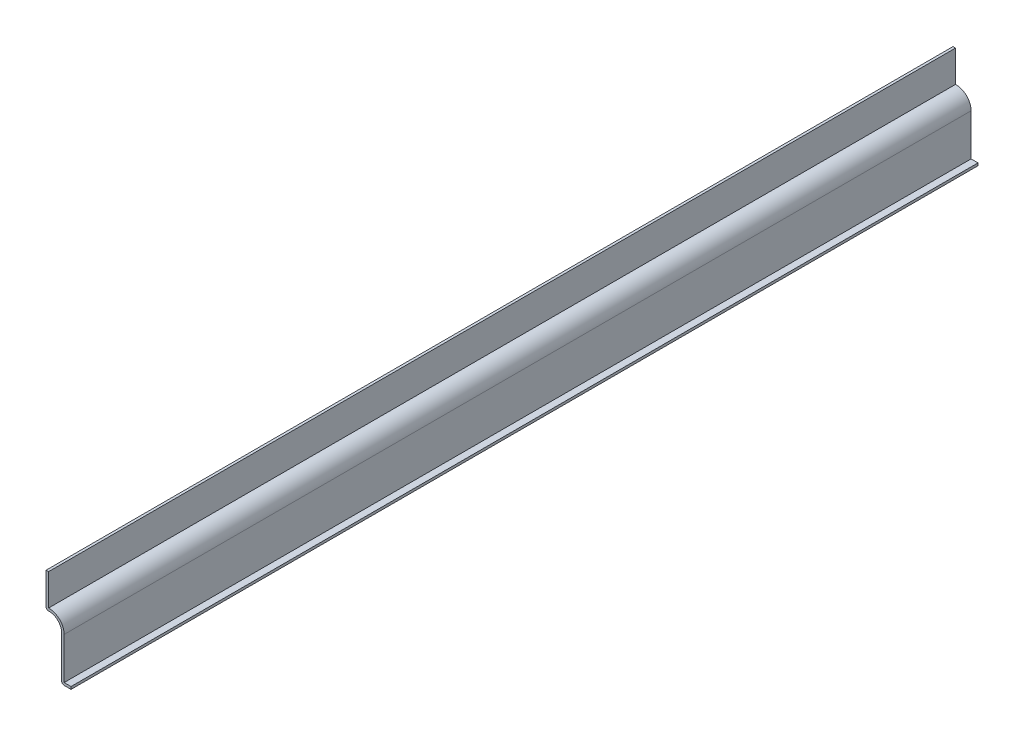
ISO-10303-21;
HEADER;
FILE_DESCRIPTION(('STEP AP214'),'2;1');
FILE_NAME('part.step','',(''),(''),'','','');
FILE_SCHEMA(('AUTOMOTIVE_DESIGN { 1 0 10303 214 1 1 1 1 }'));
ENDSEC;
DATA;
#1=APPLICATION_CONTEXT('core data for automotive mechanical design processes');
#2=APPLICATION_PROTOCOL_DEFINITION('international standard','automotive_design',2000,#1);
#3=PRODUCT_CONTEXT('',#1,'mechanical');
#4=PRODUCT('Part','Part','',(#3));
#5=PRODUCT_RELATED_PRODUCT_CATEGORY('part','',(#4));
#6=PRODUCT_DEFINITION_FORMATION('','',#4);
#7=PRODUCT_DEFINITION_CONTEXT('part definition',#1,'design');
#8=PRODUCT_DEFINITION('design','',#6,#7);
#9=PRODUCT_DEFINITION_SHAPE('','',#8);
#10=(LENGTH_UNIT() NAMED_UNIT(*) SI_UNIT(.MILLI.,.METRE.));
#11=(NAMED_UNIT(*) PLANE_ANGLE_UNIT() SI_UNIT($,.RADIAN.));
#12=(NAMED_UNIT(*) SI_UNIT($,.STERADIAN.) SOLID_ANGLE_UNIT());
#13=UNCERTAINTY_MEASURE_WITH_UNIT(LENGTH_MEASURE(1.E-05),#10,'distance_accuracy_value','');
#14=(GEOMETRIC_REPRESENTATION_CONTEXT(3) GLOBAL_UNCERTAINTY_ASSIGNED_CONTEXT((#13)) GLOBAL_UNIT_ASSIGNED_CONTEXT((#10,
#11,#12)) REPRESENTATION_CONTEXT('',''));
#15=CARTESIAN_POINT('',(0.,0.,0.));
#16=DIRECTION('',(0.,0.,1.));
#17=DIRECTION('',(1.,0.,0.));
#18=AXIS2_PLACEMENT_3D('',#15,#16,#17);
#19=CARTESIAN_POINT('',(-11.43,28.575,-460.375));
#20=DIRECTION('',(1.,0.,0.));
#21=DIRECTION('',(0.,0.,-1.));
#22=AXIS2_PLACEMENT_3D('',#19,#20,#21);
#23=PLANE('',#22);
#24=DIRECTION('',(0.,1.,0.));
#25=VECTOR('',#24,1.);
#26=CARTESIAN_POINT('',(-11.43,28.575,0.));
#27=LINE('',#26,#25);
#28=CARTESIAN_POINT('',(-11.43,30.0400214811547,0.));
#29=VERTEX_POINT('',#28);
#30=CARTESIAN_POINT('',(-11.43,46.0375,0.));
#31=VERTEX_POINT('',#30);
#32=EDGE_CURVE('E170',#29,#31,#27,.T.);
#33=ORIENTED_EDGE('',*,*,#32,.F.);
#34=DIRECTION('',(0.,0.,1.));
#35=VECTOR('',#34,1.);
#36=CARTESIAN_POINT('',(-11.43,30.0400214811547,-460.375));
#37=LINE('',#36,#35);
#38=CARTESIAN_POINT('',(-11.43,30.0400214811547,-460.375));
#39=VERTEX_POINT('',#38);
#40=EDGE_CURVE('E147',#39,#29,#37,.T.);
#41=ORIENTED_EDGE('',*,*,#40,.F.);
#42=DIRECTION('',(0.,1.,0.));
#43=VECTOR('',#42,1.);
#44=CARTESIAN_POINT('',(-11.43,28.575,-460.375));
#45=LINE('',#44,#43);
#46=CARTESIAN_POINT('',(-11.43,46.0375,-460.375));
#47=VERTEX_POINT('',#46);
#48=EDGE_CURVE('E129',#39,#47,#45,.T.);
#49=ORIENTED_EDGE('',*,*,#48,.T.);
#50=DIRECTION('',(0.,0.,1.));
#51=VECTOR('',#50,1.);
#52=CARTESIAN_POINT('',(-11.43,46.0375,-460.375));
#53=LINE('',#52,#51);
#54=EDGE_CURVE('E137',#47,#31,#53,.T.);
#55=ORIENTED_EDGE('',*,*,#54,.T.);
#56=EDGE_LOOP('',(#33,#41,#49,#55));
#57=FACE_BOUND('',#56,.T.);
#58=ADVANCED_FACE('F35',(#57),#23,.T.);
#59=CARTESIAN_POINT('',(-11.1125,22.4266389378957,-460.375));
#60=DIRECTION('',(0.,0.,1.));
#61=DIRECTION('',(1.,0.,0.));
#62=AXIS2_PLACEMENT_3D('',#59,#60,#61);
#63=CYLINDRICAL_SURFACE('',#62,7.62);
#64=CARTESIAN_POINT('',(-11.1125,22.4266389378957,0.));
#65=DIRECTION('',(0.,0.,1.));
#66=DIRECTION('',(1.,0.,0.));
#67=AXIS2_PLACEMENT_3D('',#64,#65,#66);
#68=CIRCLE('',#67,7.62);
#69=CARTESIAN_POINT('',(-3.4925,22.4266389378957,0.));
#70=VERTEX_POINT('',#69);
#71=EDGE_CURVE('E148',#70,#29,#68,.T.);
#72=ORIENTED_EDGE('',*,*,#71,.F.);
#73=DIRECTION('',(0.,0.,1.));
#74=VECTOR('',#73,1.);
#75=CARTESIAN_POINT('',(-3.4925,22.4266389378957,-460.375));
#76=LINE('',#75,#74);
#77=CARTESIAN_POINT('',(-3.4925,22.4266389378957,-460.375));
#78=VERTEX_POINT('',#77);
#79=EDGE_CURVE('E191',#78,#70,#76,.T.);
#80=ORIENTED_EDGE('',*,*,#79,.F.);
#81=CARTESIAN_POINT('',(-11.1125,22.4266389378957,-460.375));
#82=DIRECTION('',(0.,0.,1.));
#83=DIRECTION('',(1.,0.,0.));
#84=AXIS2_PLACEMENT_3D('',#81,#82,#83);
#85=CIRCLE('',#84,7.62);
#86=EDGE_CURVE('E145',#78,#39,#85,.T.);
#87=ORIENTED_EDGE('',*,*,#86,.T.);
#88=ORIENTED_EDGE('',*,*,#40,.T.);
#89=EDGE_LOOP('',(#72,#80,#87,#88));
#90=FACE_BOUND('',#89,.T.);
#91=ADVANCED_FACE('F227',(#90),#63,.T.);
#92=CARTESIAN_POINT('',(-3.4925,0.,-460.375));
#93=DIRECTION('',(1.,0.,0.));
#94=DIRECTION('',(0.,1.,0.));
#95=AXIS2_PLACEMENT_3D('',#92,#93,#94);
#96=PLANE('',#95);
#97=DIRECTION('',(0.,1.,0.));
#98=VECTOR('',#97,1.);
#99=CARTESIAN_POINT('',(-3.4925,0.,0.));
#100=LINE('',#99,#98);
#101=CARTESIAN_POINT('',(-3.4925,1.27,0.));
#102=VERTEX_POINT('',#101);
#103=EDGE_CURVE('E151',#102,#70,#100,.T.);
#104=ORIENTED_EDGE('',*,*,#103,.F.);
#105=DIRECTION('',(0.,0.,1.));
#106=VECTOR('',#105,1.);
#107=CARTESIAN_POINT('',(-3.4925,1.27,-460.375));
#108=LINE('',#107,#106);
#109=CARTESIAN_POINT('',(-3.4925,1.27,-460.375));
#110=VERTEX_POINT('',#109);
#111=EDGE_CURVE('E193',#110,#102,#108,.T.);
#112=ORIENTED_EDGE('',*,*,#111,.F.);
#113=DIRECTION('',(0.,1.,0.));
#114=VECTOR('',#113,1.);
#115=CARTESIAN_POINT('',(-3.4925,0.,-460.375));
#116=LINE('',#115,#114);
#117=EDGE_CURVE('E166',#110,#78,#116,.T.);
#118=ORIENTED_EDGE('',*,*,#117,.T.);
#119=ORIENTED_EDGE('',*,*,#79,.T.);
#120=EDGE_LOOP('',(#104,#112,#118,#119));
#121=FACE_BOUND('',#120,.T.);
#122=ADVANCED_FACE('F261',(#121),#96,.T.);
#123=CARTESIAN_POINT('',(0.,1.27,-460.375));
#124=DIRECTION('',(0.,1.,0.));
#125=DIRECTION('',(-1.,0.,0.));
#126=AXIS2_PLACEMENT_3D('',#123,#124,#125);
#127=PLANE('',#126);
#128=DIRECTION('',(-1.,0.,0.));
#129=VECTOR('',#128,1.);
#130=CARTESIAN_POINT('',(0.,1.27,0.));
#131=LINE('',#130,#129);
#132=CARTESIAN_POINT('',(0.,1.27,0.));
#133=VERTEX_POINT('',#132);
#134=EDGE_CURVE('E184',#133,#102,#131,.T.);
#135=ORIENTED_EDGE('',*,*,#134,.F.);
#136=DIRECTION('',(0.,0.,1.));
#137=VECTOR('',#136,1.);
#138=CARTESIAN_POINT('',(0.,1.27,-460.375));
#139=LINE('',#138,#137);
#140=CARTESIAN_POINT('',(0.,1.27,-460.375));
#141=VERTEX_POINT('',#140);
#142=EDGE_CURVE('E195',#141,#133,#139,.T.);
#143=ORIENTED_EDGE('',*,*,#142,.F.);
#144=DIRECTION('',(-1.,0.,0.));
#145=VECTOR('',#144,1.);
#146=CARTESIAN_POINT('',(0.,1.27,-460.375));
#147=LINE('',#146,#145);
#148=EDGE_CURVE('E163',#141,#110,#147,.T.);
#149=ORIENTED_EDGE('',*,*,#148,.T.);
#150=ORIENTED_EDGE('',*,*,#111,.T.);
#151=EDGE_LOOP('',(#135,#143,#149,#150));
#152=FACE_BOUND('',#151,.T.);
#153=ADVANCED_FACE('F233',(#152),#127,.T.);
#154=CARTESIAN_POINT('',(0.,1.27,-460.375));
#155=DIRECTION('',(-1.,0.,0.));
#156=DIRECTION('',(0.,-1.,0.));
#157=AXIS2_PLACEMENT_3D('',#154,#155,#156);
#158=PLANE('',#157);
#159=DIRECTION('',(0.,-1.,0.));
#160=VECTOR('',#159,1.);
#161=CARTESIAN_POINT('',(0.,1.27,0.));
#162=LINE('',#161,#160);
#163=CARTESIAN_POINT('',(0.,0.,0.));
#164=VERTEX_POINT('',#163);
#165=EDGE_CURVE('E182',#133,#164,#162,.T.);
#166=ORIENTED_EDGE('',*,*,#165,.T.);
#167=DIRECTION('',(0.,0.,1.));
#168=VECTOR('',#167,1.);
#169=CARTESIAN_POINT('',(0.,0.,-460.375));
#170=LINE('',#169,#168);
#171=CARTESIAN_POINT('',(0.,0.,-460.375));
#172=VERTEX_POINT('',#171);
#173=EDGE_CURVE('E197',#172,#164,#170,.T.);
#174=ORIENTED_EDGE('',*,*,#173,.F.);
#175=DIRECTION('',(0.,-1.,0.));
#176=VECTOR('',#175,1.);
#177=CARTESIAN_POINT('',(0.,1.27,-460.375));
#178=LINE('',#177,#176);
#179=EDGE_CURVE('E161',#141,#172,#178,.T.);
#180=ORIENTED_EDGE('',*,*,#179,.F.);
#181=ORIENTED_EDGE('',*,*,#142,.T.);
#182=EDGE_LOOP('',(#166,#174,#180,#181));
#183=FACE_BOUND('',#182,.T.);
#184=ADVANCED_FACE('F238',(#183),#158,.F.);
#185=CARTESIAN_POINT('',(0.,0.,-460.375));
#186=DIRECTION('',(0.,1.,0.));
#187=DIRECTION('',(-1.,0.,0.));
#188=AXIS2_PLACEMENT_3D('',#185,#186,#187);
#189=PLANE('',#188);
#190=DIRECTION('',(-1.,0.,0.));
#191=VECTOR('',#190,1.);
#192=CARTESIAN_POINT('',(0.,0.,0.));
#193=LINE('',#192,#191);
#194=CARTESIAN_POINT('',(-3.4925,0.,0.));
#195=VERTEX_POINT('',#194);
#196=EDGE_CURVE('E179',#164,#195,#193,.T.);
#197=ORIENTED_EDGE('',*,*,#196,.T.);
#198=DIRECTION('',(0.,0.,1.));
#199=VECTOR('',#198,1.);
#200=CARTESIAN_POINT('',(-3.4925,0.,-460.375));
#201=LINE('',#200,#199);
#202=CARTESIAN_POINT('',(-3.4925,0.,-460.375));
#203=VERTEX_POINT('',#202);
#204=EDGE_CURVE('E210',#195,#203,#201,.F.);
#205=ORIENTED_EDGE('',*,*,#204,.T.);
#206=DIRECTION('',(-1.,0.,0.));
#207=VECTOR('',#206,1.);
#208=CARTESIAN_POINT('',(0.,0.,-460.375));
#209=LINE('',#208,#207);
#210=EDGE_CURVE('E159',#172,#203,#209,.T.);
#211=ORIENTED_EDGE('',*,*,#210,.F.);
#212=ORIENTED_EDGE('',*,*,#173,.T.);
#213=EDGE_LOOP('',(#197,#205,#211,#212));
#214=FACE_BOUND('',#213,.T.);
#215=ADVANCED_FACE('F272',(#214),#189,.F.);
#216=CARTESIAN_POINT('',(-4.7625,0.,-460.375));
#217=DIRECTION('',(1.,0.,0.));
#218=DIRECTION('',(0.,1.,0.));
#219=AXIS2_PLACEMENT_3D('',#216,#217,#218);
#220=PLANE('',#219);
#221=DIRECTION('',(0.,1.,0.));
#222=VECTOR('',#221,1.);
#223=CARTESIAN_POINT('',(-4.7625,0.,-460.375));
#224=LINE('',#223,#222);
#225=CARTESIAN_POINT('',(-4.7625,1.27,-460.375));
#226=VERTEX_POINT('',#225);
#227=CARTESIAN_POINT('',(-4.7625,22.4266389378957,-460.375));
#228=VERTEX_POINT('',#227);
#229=EDGE_CURVE('E157',#226,#228,#224,.T.);
#230=ORIENTED_EDGE('',*,*,#229,.F.);
#231=DIRECTION('',(0.,0.,1.));
#232=VECTOR('',#231,1.);
#233=CARTESIAN_POINT('',(-4.7625,1.27,-460.375));
#234=LINE('',#233,#232);
#235=CARTESIAN_POINT('',(-4.7625,1.27,0.));
#236=VERTEX_POINT('',#235);
#237=EDGE_CURVE('E190',#226,#236,#234,.T.);
#238=ORIENTED_EDGE('',*,*,#237,.T.);
#239=DIRECTION('',(0.,1.,0.));
#240=VECTOR('',#239,1.);
#241=CARTESIAN_POINT('',(-4.7625,0.,0.));
#242=LINE('',#241,#240);
#243=CARTESIAN_POINT('',(-4.7625,22.4266389378957,0.));
#244=VERTEX_POINT('',#243);
#245=EDGE_CURVE('E177',#236,#244,#242,.T.);
#246=ORIENTED_EDGE('',*,*,#245,.T.);
#247=DIRECTION('',(0.,0.,1.));
#248=VECTOR('',#247,1.);
#249=CARTESIAN_POINT('',(-4.7625,22.4266389378957,-460.375));
#250=LINE('',#249,#248);
#251=EDGE_CURVE('E200',#228,#244,#250,.T.);
#252=ORIENTED_EDGE('',*,*,#251,.F.);
#253=EDGE_LOOP('',(#230,#238,#246,#252));
#254=FACE_BOUND('',#253,.T.);
#255=ADVANCED_FACE('F248',(#254),#220,.F.);
#256=CARTESIAN_POINT('',(-11.1125,22.4266389378957,-460.375));
#257=DIRECTION('',(0.,0.,1.));
#258=DIRECTION('',(1.,0.,0.));
#259=AXIS2_PLACEMENT_3D('',#256,#257,#258);
#260=CYLINDRICAL_SURFACE('',#259,6.35);
#261=CARTESIAN_POINT('',(-11.1125,22.4266389378957,0.));
#262=DIRECTION('',(0.,0.,1.));
#263=DIRECTION('',(1.,0.,0.));
#264=AXIS2_PLACEMENT_3D('',#261,#262,#263);
#265=CIRCLE('',#264,6.35);
#266=CARTESIAN_POINT('',(-11.3770833333333,28.7711243906115,0.));
#267=VERTEX_POINT('',#266);
#268=EDGE_CURVE('E175',#244,#267,#265,.T.);
#269=ORIENTED_EDGE('',*,*,#268,.T.);
#270=DIRECTION('',(0.,0.,1.));
#271=VECTOR('',#270,1.);
#272=CARTESIAN_POINT('',(-11.3770833333333,28.7711243906115,-460.375));
#273=LINE('',#272,#271);
#274=CARTESIAN_POINT('',(-11.3770833333333,28.7711243906115,-460.375));
#275=VERTEX_POINT('',#274);
#276=EDGE_CURVE('E11',#267,#275,#273,.F.);
#277=ORIENTED_EDGE('',*,*,#276,.T.);
#278=CARTESIAN_POINT('',(-11.1125,22.4266389378957,-460.375));
#279=DIRECTION('',(0.,0.,1.));
#280=DIRECTION('',(1.,0.,0.));
#281=AXIS2_PLACEMENT_3D('',#278,#279,#280);
#282=CIRCLE('',#281,6.35);
#283=EDGE_CURVE('E155',#228,#275,#282,.T.);
#284=ORIENTED_EDGE('',*,*,#283,.F.);
#285=ORIENTED_EDGE('',*,*,#251,.T.);
#286=EDGE_LOOP('',(#269,#277,#284,#285));
#287=FACE_BOUND('',#286,.T.);
#288=ADVANCED_FACE('F251',(#287),#260,.F.);
#289=CARTESIAN_POINT('',(-12.7,28.575,-460.375));
#290=DIRECTION('',(1.,0.,0.));
#291=DIRECTION('',(0.,0.,-1.));
#292=AXIS2_PLACEMENT_3D('',#289,#290,#291);
#293=PLANE('',#292);
#294=DIRECTION('',(0.,1.,0.));
#295=VECTOR('',#294,1.);
#296=CARTESIAN_POINT('',(-12.7,28.575,-460.375));
#297=LINE('',#296,#295);
#298=CARTESIAN_POINT('',(-12.7,30.0400214811547,-460.375));
#299=VERTEX_POINT('',#298);
#300=CARTESIAN_POINT('',(-12.7,46.0375,-460.375));
#301=VERTEX_POINT('',#300);
#302=EDGE_CURVE('E131',#299,#301,#297,.T.);
#303=ORIENTED_EDGE('',*,*,#302,.F.);
#304=DIRECTION('',(0.,0.,1.));
#305=VECTOR('',#304,1.);
#306=CARTESIAN_POINT('',(-12.7,30.0400214811547,-460.375));
#307=LINE('',#306,#305);
#308=CARTESIAN_POINT('',(-12.7,30.0400214811547,0.));
#309=VERTEX_POINT('',#308);
#310=EDGE_CURVE('E43',#299,#309,#307,.T.);
#311=ORIENTED_EDGE('',*,*,#310,.T.);
#312=DIRECTION('',(0.,1.,0.));
#313=VECTOR('',#312,1.);
#314=CARTESIAN_POINT('',(-12.7,28.575,0.));
#315=LINE('',#314,#313);
#316=CARTESIAN_POINT('',(-12.7,46.0375,0.));
#317=VERTEX_POINT('',#316);
#318=EDGE_CURVE('E173',#309,#317,#315,.T.);
#319=ORIENTED_EDGE('',*,*,#318,.T.);
#320=DIRECTION('',(0.,0.,1.));
#321=VECTOR('',#320,1.);
#322=CARTESIAN_POINT('',(-12.7,46.0375,-460.375));
#323=LINE('',#322,#321);
#324=EDGE_CURVE('E144',#301,#317,#323,.T.);
#325=ORIENTED_EDGE('',*,*,#324,.F.);
#326=EDGE_LOOP('',(#303,#311,#319,#325));
#327=FACE_BOUND('',#326,.T.);
#328=ADVANCED_FACE('F218',(#327),#293,.F.);
#329=CARTESIAN_POINT('',(-12.7,46.0375,-460.375));
#330=DIRECTION('',(0.,-1.,0.));
#331=DIRECTION('',(0.,0.,-1.));
#332=AXIS2_PLACEMENT_3D('',#329,#330,#331);
#333=PLANE('',#332);
#334=DIRECTION('',(1.,0.,0.));
#335=VECTOR('',#334,1.);
#336=CARTESIAN_POINT('',(-12.7,46.0375,0.));
#337=LINE('',#336,#335);
#338=EDGE_CURVE('E140',#317,#31,#337,.T.);
#339=ORIENTED_EDGE('',*,*,#338,.T.);
#340=ORIENTED_EDGE('',*,*,#54,.F.);
#341=DIRECTION('',(1.,0.,0.));
#342=VECTOR('',#341,1.);
#343=CARTESIAN_POINT('',(-12.7,46.0375,-460.375));
#344=LINE('',#343,#342);
#345=EDGE_CURVE('E123',#301,#47,#344,.T.);
#346=ORIENTED_EDGE('',*,*,#345,.F.);
#347=ORIENTED_EDGE('',*,*,#324,.T.);
#348=EDGE_LOOP('',(#339,#340,#346,#347));
#349=FACE_BOUND('',#348,.T.);
#350=ADVANCED_FACE('F138',(#349),#333,.F.);
#351=CARTESIAN_POINT('',(-11.1125,22.4266389378957,-460.375));
#352=DIRECTION('',(0.,0.,1.));
#353=DIRECTION('',(1.,0.,0.));
#354=AXIS2_PLACEMENT_3D('',#351,#352,#353);
#355=PLANE('',#354);
#356=ORIENTED_EDGE('',*,*,#210,.T.);
#357=CARTESIAN_POINT('',(-3.4925,1.27,-460.375));
#358=DIRECTION('',(0.,0.,1.));
#359=DIRECTION('',(1.,0.,0.));
#360=AXIS2_PLACEMENT_3D('',#357,#358,#359);
#361=CIRCLE('',#360,1.27);
#362=EDGE_CURVE('E213',#203,#226,#361,.F.);
#363=ORIENTED_EDGE('',*,*,#362,.T.);
#364=ORIENTED_EDGE('',*,*,#229,.T.);
#365=ORIENTED_EDGE('',*,*,#283,.T.);
#366=CARTESIAN_POINT('',(-11.43,30.0400214811547,-460.375));
#367=DIRECTION('',(0.,0.,1.));
#368=DIRECTION('',(1.,0.,0.));
#369=AXIS2_PLACEMENT_3D('',#366,#367,#368);
#370=CIRCLE('',#369,1.27);
#371=EDGE_CURVE('E50',#275,#299,#370,.F.);
#372=ORIENTED_EDGE('',*,*,#371,.T.);
#373=ORIENTED_EDGE('',*,*,#302,.T.);
#374=ORIENTED_EDGE('',*,*,#345,.T.);
#375=ORIENTED_EDGE('',*,*,#48,.F.);
#376=ORIENTED_EDGE('',*,*,#86,.F.);
#377=ORIENTED_EDGE('',*,*,#117,.F.);
#378=ORIENTED_EDGE('',*,*,#148,.F.);
#379=ORIENTED_EDGE('',*,*,#179,.T.);
#380=EDGE_LOOP('',(#356,#363,#364,#365,#372,#373,#374,#375,#376,#377,#378,#379));
#381=FACE_BOUND('',#380,.T.);
#382=ADVANCED_FACE('F126',(#381),#355,.F.);
#383=CARTESIAN_POINT('',(-11.1125,22.4266389378957,0.));
#384=DIRECTION('',(0.,0.,1.));
#385=DIRECTION('',(1.,0.,0.));
#386=AXIS2_PLACEMENT_3D('',#383,#384,#385);
#387=PLANE('',#386);
#388=ORIENTED_EDGE('',*,*,#245,.F.);
#389=CARTESIAN_POINT('',(-3.4925,1.27,0.));
#390=DIRECTION('',(0.,0.,1.));
#391=DIRECTION('',(1.,0.,0.));
#392=AXIS2_PLACEMENT_3D('',#389,#390,#391);
#393=CIRCLE('',#392,1.27);
#394=EDGE_CURVE('E208',#236,#195,#393,.T.);
#395=ORIENTED_EDGE('',*,*,#394,.T.);
#396=ORIENTED_EDGE('',*,*,#196,.F.);
#397=ORIENTED_EDGE('',*,*,#165,.F.);
#398=ORIENTED_EDGE('',*,*,#134,.T.);
#399=ORIENTED_EDGE('',*,*,#103,.T.);
#400=ORIENTED_EDGE('',*,*,#71,.T.);
#401=ORIENTED_EDGE('',*,*,#32,.T.);
#402=ORIENTED_EDGE('',*,*,#338,.F.);
#403=ORIENTED_EDGE('',*,*,#318,.F.);
#404=CARTESIAN_POINT('',(-11.43,30.0400214811547,0.));
#405=DIRECTION('',(0.,0.,1.));
#406=DIRECTION('',(1.,0.,0.));
#407=AXIS2_PLACEMENT_3D('',#404,#405,#406);
#408=CIRCLE('',#407,1.27);
#409=EDGE_CURVE('E206',#309,#267,#408,.T.);
#410=ORIENTED_EDGE('',*,*,#409,.T.);
#411=ORIENTED_EDGE('',*,*,#268,.F.);
#412=EDGE_LOOP('',(#388,#395,#396,#397,#398,#399,#400,#401,#402,#403,#410,#411));
#413=FACE_BOUND('',#412,.T.);
#414=ADVANCED_FACE('F222',(#413),#387,.T.);
#415=CARTESIAN_POINT('',(-3.4925,1.27,-460.375));
#416=DIRECTION('',(0.,0.,1.));
#417=DIRECTION('',(1.,0.,0.));
#418=AXIS2_PLACEMENT_3D('',#415,#416,#417);
#419=CYLINDRICAL_SURFACE('',#418,1.27);
#420=ORIENTED_EDGE('',*,*,#362,.F.);
#421=ORIENTED_EDGE('',*,*,#204,.F.);
#422=ORIENTED_EDGE('',*,*,#394,.F.);
#423=ORIENTED_EDGE('',*,*,#237,.F.);
#424=EDGE_LOOP('',(#420,#421,#422,#423));
#425=FACE_BOUND('',#424,.T.);
#426=ADVANCED_FACE('F246',(#425),#419,.T.);
#427=CARTESIAN_POINT('',(-11.43,30.0400214811547,-460.375));
#428=DIRECTION('',(0.,0.,1.));
#429=DIRECTION('',(1.,0.,0.));
#430=AXIS2_PLACEMENT_3D('',#427,#428,#429);
#431=CYLINDRICAL_SURFACE('',#430,1.27);
#432=ORIENTED_EDGE('',*,*,#371,.F.);
#433=ORIENTED_EDGE('',*,*,#276,.F.);
#434=ORIENTED_EDGE('',*,*,#409,.F.);
#435=ORIENTED_EDGE('',*,*,#310,.F.);
#436=EDGE_LOOP('',(#432,#433,#434,#435));
#437=FACE_BOUND('',#436,.T.);
#438=ADVANCED_FACE('F37',(#437),#431,.T.);
#439=CLOSED_SHELL('',(#58,#91,#122,#153,#184,#215,#255,#288,#328,#350,#382,#414,#426,#438));
#440=MANIFOLD_SOLID_BREP('B2',#439);
#441=ADVANCED_BREP_SHAPE_REPRESENTATION('',(#18,#440),#14);
#442=SHAPE_DEFINITION_REPRESENTATION(#9,#441);
ENDSEC;
END-ISO-10303-21;
